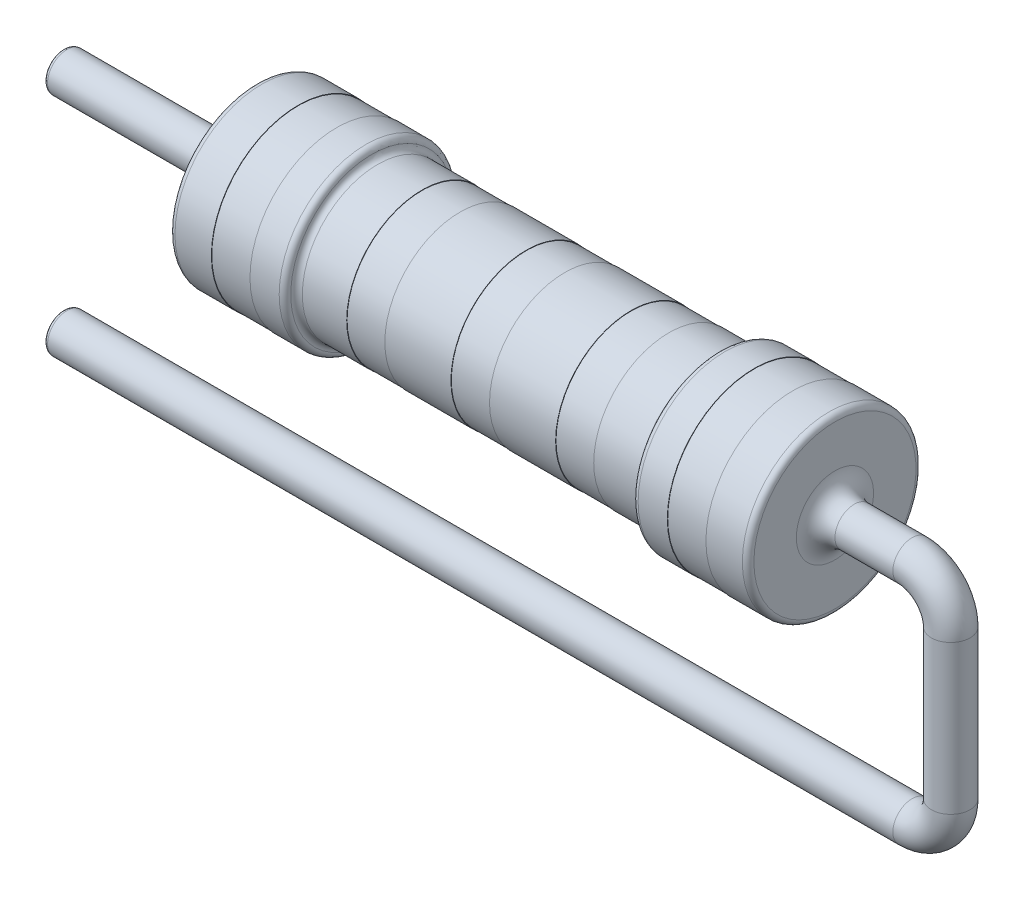
ISO-10303-21;
HEADER;
FILE_DESCRIPTION(('STEP AP214'),'2;1');
FILE_NAME('part.step','',(''),(''),'','','');
FILE_SCHEMA(('AUTOMOTIVE_DESIGN { 1 0 10303 214 1 1 1 1 }'));
ENDSEC;
DATA;
#1=APPLICATION_CONTEXT('core data for automotive mechanical design processes');
#2=APPLICATION_PROTOCOL_DEFINITION('international standard','automotive_design',2000,#1);
#3=PRODUCT_CONTEXT('',#1,'mechanical');
#4=PRODUCT('Part','Part','',(#3));
#5=PRODUCT_RELATED_PRODUCT_CATEGORY('part','',(#4));
#6=PRODUCT_DEFINITION_FORMATION('','',#4);
#7=PRODUCT_DEFINITION_CONTEXT('part definition',#1,'design');
#8=PRODUCT_DEFINITION('design','',#6,#7);
#9=PRODUCT_DEFINITION_SHAPE('','',#8);
#10=(LENGTH_UNIT() NAMED_UNIT(*) SI_UNIT(.MILLI.,.METRE.));
#11=(NAMED_UNIT(*) PLANE_ANGLE_UNIT() SI_UNIT($,.RADIAN.));
#12=(NAMED_UNIT(*) SI_UNIT($,.STERADIAN.) SOLID_ANGLE_UNIT());
#13=UNCERTAINTY_MEASURE_WITH_UNIT(LENGTH_MEASURE(1.E-05),#10,'distance_accuracy_value','');
#14=(GEOMETRIC_REPRESENTATION_CONTEXT(3) GLOBAL_UNCERTAINTY_ASSIGNED_CONTEXT((#13)) GLOBAL_UNIT_ASSIGNED_CONTEXT((#10,
#11,#12)) REPRESENTATION_CONTEXT('',''));
#15=CARTESIAN_POINT('',(0.,0.,0.));
#16=DIRECTION('',(0.,0.,1.));
#17=DIRECTION('',(1.,0.,0.));
#18=AXIS2_PLACEMENT_3D('',#15,#16,#17);
#19=CARTESIAN_POINT('',(7.5,-1.89738903908675,0.));
#20=DIRECTION('',(-1.,0.,0.));
#21=DIRECTION('',(0.,0.,1.));
#22=AXIS2_PLACEMENT_3D('',#19,#20,#21);
#23=PLANE('',#22);
#24=CARTESIAN_POINT('',(7.5,-1.89738903908675,0.));
#25=DIRECTION('',(-1.,0.,0.));
#26=DIRECTION('',(0.,0.,1.));
#27=AXIS2_PLACEMENT_3D('',#24,#25,#26);
#28=CIRCLE('',#27,1.);
#29=CARTESIAN_POINT('',(7.5,-1.89738903908675,1.));
#30=VERTEX_POINT('',#29);
#31=EDGE_CURVE('E51',#30,#30,#28,.T.);
#32=ORIENTED_EDGE('',*,*,#31,.T.);
#33=EDGE_LOOP('',(#32));
#34=FACE_BOUND('',#33,.T.);
#35=CARTESIAN_POINT('',(7.5,-1.89738903908675,0.));
#36=DIRECTION('',(-1.,0.,0.));
#37=DIRECTION('',(0.,0.,1.));
#38=AXIS2_PLACEMENT_3D('',#35,#36,#37);
#39=CIRCLE('',#38,2.1);
#40=CARTESIAN_POINT('',(7.5,-1.89738903908675,2.1));
#41=VERTEX_POINT('',#40);
#42=EDGE_CURVE('E87',#41,#41,#39,.F.);
#43=ORIENTED_EDGE('',*,*,#42,.T.);
#44=EDGE_LOOP('',(#43));
#45=FACE_BOUND('',#44,.T.);
#46=ADVANCED_FACE('F36',(#34,#45),#23,.F.);
#47=CARTESIAN_POINT('',(-7.5,-1.89738903908675,0.));
#48=DIRECTION('',(-1.,0.,0.));
#49=DIRECTION('',(0.,0.,1.));
#50=AXIS2_PLACEMENT_3D('',#47,#48,#49);
#51=CYLINDRICAL_SURFACE('',#50,2.25);
#52=CARTESIAN_POINT('',(-7.35,-1.89738903908675,0.));
#53=DIRECTION('',(-1.,0.,0.));
#54=DIRECTION('',(0.,0.,1.));
#55=AXIS2_PLACEMENT_3D('',#52,#53,#54);
#56=CIRCLE('',#55,2.25);
#57=CARTESIAN_POINT('',(-7.35,-1.89738903908675,2.25));
#58=VERTEX_POINT('',#57);
#59=EDGE_CURVE('E95',#58,#58,#56,.F.);
#60=ORIENTED_EDGE('',*,*,#59,.T.);
#61=EDGE_LOOP('',(#60));
#62=FACE_BOUND('',#61,.T.);
#63=CARTESIAN_POINT('',(-6.40684922175231,-1.89738903908675,0.));
#64=DIRECTION('',(-1.,0.,0.));
#65=DIRECTION('',(0.,0.,1.));
#66=AXIS2_PLACEMENT_3D('',#63,#64,#65);
#67=CIRCLE('',#66,2.25);
#68=CARTESIAN_POINT('',(-6.40684922175231,-1.89738903908675,2.25));
#69=VERTEX_POINT('',#68);
#70=EDGE_CURVE('E119',#69,#69,#67,.T.);
#71=ORIENTED_EDGE('',*,*,#70,.T.);
#72=EDGE_LOOP('',(#71));
#73=FACE_BOUND('',#72,.T.);
#74=ADVANCED_FACE('F231',(#62,#73),#51,.T.);
#75=CARTESIAN_POINT('',(-6.40684922175231,-4.14738903908675,0.));
#76=DIRECTION('',(1.,0.,0.));
#77=DIRECTION('',(0.,0.,-1.));
#78=AXIS2_PLACEMENT_3D('',#75,#76,#77);
#79=PLANE('',#78);
#80=CARTESIAN_POINT('',(-6.40684922175231,-1.89738903908675,0.));
#81=DIRECTION('',(-1.,0.,0.));
#82=DIRECTION('',(0.,0.,1.));
#83=AXIS2_PLACEMENT_3D('',#80,#81,#82);
#84=CIRCLE('',#83,2.24);
#85=CARTESIAN_POINT('',(-6.40684922175231,-1.89738903908675,2.24));
#86=VERTEX_POINT('',#85);
#87=EDGE_CURVE('E123',#86,#86,#84,.T.);
#88=ORIENTED_EDGE('',*,*,#87,.T.);
#89=EDGE_LOOP('',(#88));
#90=FACE_BOUND('',#89,.T.);
#91=ORIENTED_EDGE('',*,*,#70,.F.);
#92=EDGE_LOOP('',(#91));
#93=FACE_BOUND('',#92,.T.);
#94=ADVANCED_FACE('F237',(#90,#93),#79,.T.);
#95=CARTESIAN_POINT('',(-7.5,-1.89738903908675,0.));
#96=DIRECTION('',(-1.,0.,0.));
#97=DIRECTION('',(0.,0.,1.));
#98=AXIS2_PLACEMENT_3D('',#95,#96,#97);
#99=CYLINDRICAL_SURFACE('',#98,2.24);
#100=CARTESIAN_POINT('',(-5.40684922175231,-1.89738903908675,0.));
#101=DIRECTION('',(-1.,0.,0.));
#102=DIRECTION('',(0.,0.,1.));
#103=AXIS2_PLACEMENT_3D('',#100,#101,#102);
#104=CIRCLE('',#103,2.24);
#105=CARTESIAN_POINT('',(-5.40684922175231,-1.89738903908675,2.24));
#106=VERTEX_POINT('',#105);
#107=EDGE_CURVE('E127',#106,#106,#104,.T.);
#108=ORIENTED_EDGE('',*,*,#107,.T.);
#109=EDGE_LOOP('',(#108));
#110=FACE_BOUND('',#109,.T.);
#111=ORIENTED_EDGE('',*,*,#87,.F.);
#112=EDGE_LOOP('',(#111));
#113=FACE_BOUND('',#112,.T.);
#114=ADVANCED_FACE('F324',(#110,#113),#99,.T.);
#115=CARTESIAN_POINT('',(-5.40684922175231,-4.13738903908675,0.));
#116=DIRECTION('',(-1.,0.,0.));
#117=DIRECTION('',(0.,0.,1.));
#118=AXIS2_PLACEMENT_3D('',#115,#116,#117);
#119=PLANE('',#118);
#120=CARTESIAN_POINT('',(-5.40684922175231,-1.89738903908675,0.));
#121=DIRECTION('',(-1.,0.,0.));
#122=DIRECTION('',(0.,0.,1.));
#123=AXIS2_PLACEMENT_3D('',#120,#121,#122);
#124=CIRCLE('',#123,2.24999999999999);
#125=CARTESIAN_POINT('',(-5.40684922175231,-1.89738903908675,2.24999999999999));
#126=VERTEX_POINT('',#125);
#127=EDGE_CURVE('E130',#126,#126,#124,.T.);
#128=ORIENTED_EDGE('',*,*,#127,.T.);
#129=EDGE_LOOP('',(#128));
#130=FACE_BOUND('',#129,.T.);
#131=ORIENTED_EDGE('',*,*,#107,.F.);
#132=EDGE_LOOP('',(#131));
#133=FACE_BOUND('',#132,.T.);
#134=ADVANCED_FACE('F320',(#130,#133),#119,.T.);
#135=CARTESIAN_POINT('',(-7.5,-1.89738903908675,0.));
#136=DIRECTION('',(-1.,0.,0.));
#137=DIRECTION('',(0.,0.,1.));
#138=AXIS2_PLACEMENT_3D('',#135,#136,#137);
#139=CYLINDRICAL_SURFACE('',#138,2.24999999999999);
#140=CARTESIAN_POINT('',(-4.65,-1.89738903908675,0.));
#141=DIRECTION('',(1.,0.,0.));
#142=DIRECTION('',(0.,0.,-1.));
#143=AXIS2_PLACEMENT_3D('',#140,#141,#142);
#144=CIRCLE('',#143,2.24999999999999);
#145=CARTESIAN_POINT('',(-4.65,-1.89738903908675,-2.24999999999999));
#146=VERTEX_POINT('',#145);
#147=EDGE_CURVE('E107',#146,#146,#144,.F.);
#148=ORIENTED_EDGE('',*,*,#147,.T.);
#149=EDGE_LOOP('',(#148));
#150=FACE_BOUND('',#149,.T.);
#151=ORIENTED_EDGE('',*,*,#127,.F.);
#152=EDGE_LOOP('',(#151));
#153=FACE_BOUND('',#152,.T.);
#154=ADVANCED_FACE('F316',(#150,#153),#139,.T.);
#155=CARTESIAN_POINT('',(-7.5,-1.89738903908675,0.));
#156=DIRECTION('',(-1.,0.,0.));
#157=DIRECTION('',(0.,0.,1.));
#158=AXIS2_PLACEMENT_3D('',#155,#156,#157);
#159=CYLINDRICAL_SURFACE('',#158,1.95);
#160=CARTESIAN_POINT('',(-4.35,-1.89738903908675,0.));
#161=DIRECTION('',(1.,0.,0.));
#162=DIRECTION('',(0.,0.,-1.));
#163=AXIS2_PLACEMENT_3D('',#160,#161,#162);
#164=CIRCLE('',#163,1.95);
#165=CARTESIAN_POINT('',(-4.35,-1.89738903908675,-1.95));
#166=VERTEX_POINT('',#165);
#167=EDGE_CURVE('E79',#166,#166,#164,.T.);
#168=ORIENTED_EDGE('',*,*,#167,.T.);
#169=EDGE_LOOP('',(#168));
#170=FACE_BOUND('',#169,.T.);
#171=CARTESIAN_POINT('',(-3.2,-1.89738903908675,0.));
#172=DIRECTION('',(-1.,0.,0.));
#173=DIRECTION('',(0.,0.,1.));
#174=AXIS2_PLACEMENT_3D('',#171,#172,#173);
#175=CIRCLE('',#174,1.95);
#176=CARTESIAN_POINT('',(-3.2,-1.89738903908675,1.95));
#177=VERTEX_POINT('',#176);
#178=EDGE_CURVE('E134',#177,#177,#175,.T.);
#179=ORIENTED_EDGE('',*,*,#178,.T.);
#180=EDGE_LOOP('',(#179));
#181=FACE_BOUND('',#180,.T.);
#182=ADVANCED_FACE('F312',(#170,#181),#159,.T.);
#183=CARTESIAN_POINT('',(-3.2,-3.84738903908675,0.));
#184=DIRECTION('',(1.,0.,0.));
#185=DIRECTION('',(0.,0.,-1.));
#186=AXIS2_PLACEMENT_3D('',#183,#184,#185);
#187=PLANE('',#186);
#188=CARTESIAN_POINT('',(-3.2,-1.89738903908675,0.));
#189=DIRECTION('',(-1.,0.,0.));
#190=DIRECTION('',(0.,0.,1.));
#191=AXIS2_PLACEMENT_3D('',#188,#189,#190);
#192=CIRCLE('',#191,1.94);
#193=CARTESIAN_POINT('',(-3.2,-1.89738903908675,1.94));
#194=VERTEX_POINT('',#193);
#195=EDGE_CURVE('E137',#194,#194,#192,.T.);
#196=ORIENTED_EDGE('',*,*,#195,.T.);
#197=EDGE_LOOP('',(#196));
#198=FACE_BOUND('',#197,.T.);
#199=ORIENTED_EDGE('',*,*,#178,.F.);
#200=EDGE_LOOP('',(#199));
#201=FACE_BOUND('',#200,.T.);
#202=ADVANCED_FACE('F308',(#198,#201),#187,.T.);
#203=CARTESIAN_POINT('',(-7.5,-1.89738903908675,0.));
#204=DIRECTION('',(-1.,0.,0.));
#205=DIRECTION('',(0.,0.,1.));
#206=AXIS2_PLACEMENT_3D('',#203,#204,#205);
#207=CYLINDRICAL_SURFACE('',#206,1.94);
#208=CARTESIAN_POINT('',(-2.21268048519063,-1.89738903908675,0.));
#209=DIRECTION('',(-1.,0.,0.));
#210=DIRECTION('',(0.,0.,1.));
#211=AXIS2_PLACEMENT_3D('',#208,#209,#210);
#212=CIRCLE('',#211,1.94);
#213=CARTESIAN_POINT('',(-2.21268048519063,-1.89738903908675,1.94));
#214=VERTEX_POINT('',#213);
#215=EDGE_CURVE('E141',#214,#214,#212,.T.);
#216=ORIENTED_EDGE('',*,*,#215,.T.);
#217=EDGE_LOOP('',(#216));
#218=FACE_BOUND('',#217,.T.);
#219=ORIENTED_EDGE('',*,*,#195,.F.);
#220=EDGE_LOOP('',(#219));
#221=FACE_BOUND('',#220,.T.);
#222=ADVANCED_FACE('F304',(#218,#221),#207,.T.);
#223=CARTESIAN_POINT('',(-2.21268048519063,-3.83738903908675,0.));
#224=DIRECTION('',(-1.,0.,0.));
#225=DIRECTION('',(0.,0.,1.));
#226=AXIS2_PLACEMENT_3D('',#223,#224,#225);
#227=PLANE('',#226);
#228=CARTESIAN_POINT('',(-2.21268048519063,-1.89738903908675,0.));
#229=DIRECTION('',(-1.,0.,0.));
#230=DIRECTION('',(0.,0.,1.));
#231=AXIS2_PLACEMENT_3D('',#228,#229,#230);
#232=CIRCLE('',#231,1.95);
#233=CARTESIAN_POINT('',(-2.21268048519063,-1.89738903908675,1.95));
#234=VERTEX_POINT('',#233);
#235=EDGE_CURVE('E145',#234,#234,#232,.T.);
#236=ORIENTED_EDGE('',*,*,#235,.T.);
#237=EDGE_LOOP('',(#236));
#238=FACE_BOUND('',#237,.T.);
#239=ORIENTED_EDGE('',*,*,#215,.F.);
#240=EDGE_LOOP('',(#239));
#241=FACE_BOUND('',#240,.T.);
#242=ADVANCED_FACE('F300',(#238,#241),#227,.T.);
#243=CARTESIAN_POINT('',(-7.5,-1.89738903908675,0.));
#244=DIRECTION('',(-1.,0.,0.));
#245=DIRECTION('',(0.,0.,1.));
#246=AXIS2_PLACEMENT_3D('',#243,#244,#245);
#247=CYLINDRICAL_SURFACE('',#246,1.95);
#248=CARTESIAN_POINT('',(-0.5,-1.89738903908675,0.));
#249=DIRECTION('',(-1.,0.,0.));
#250=DIRECTION('',(0.,0.,1.));
#251=AXIS2_PLACEMENT_3D('',#248,#249,#250);
#252=CIRCLE('',#251,1.95);
#253=CARTESIAN_POINT('',(-0.5,-1.89738903908675,1.95));
#254=VERTEX_POINT('',#253);
#255=EDGE_CURVE('E149',#254,#254,#252,.T.);
#256=ORIENTED_EDGE('',*,*,#255,.T.);
#257=EDGE_LOOP('',(#256));
#258=FACE_BOUND('',#257,.T.);
#259=ORIENTED_EDGE('',*,*,#235,.F.);
#260=EDGE_LOOP('',(#259));
#261=FACE_BOUND('',#260,.T.);
#262=ADVANCED_FACE('F296',(#258,#261),#247,.T.);
#263=CARTESIAN_POINT('',(-0.5,-3.84738903908675,0.));
#264=DIRECTION('',(1.,0.,0.));
#265=DIRECTION('',(0.,0.,-1.));
#266=AXIS2_PLACEMENT_3D('',#263,#264,#265);
#267=PLANE('',#266);
#268=CARTESIAN_POINT('',(-0.5,-1.89738903908675,0.));
#269=DIRECTION('',(-1.,0.,0.));
#270=DIRECTION('',(0.,0.,1.));
#271=AXIS2_PLACEMENT_3D('',#268,#269,#270);
#272=CIRCLE('',#271,1.94);
#273=CARTESIAN_POINT('',(-0.5,-1.89738903908675,1.94));
#274=VERTEX_POINT('',#273);
#275=EDGE_CURVE('E153',#274,#274,#272,.T.);
#276=ORIENTED_EDGE('',*,*,#275,.T.);
#277=EDGE_LOOP('',(#276));
#278=FACE_BOUND('',#277,.T.);
#279=ORIENTED_EDGE('',*,*,#255,.F.);
#280=EDGE_LOOP('',(#279));
#281=FACE_BOUND('',#280,.T.);
#282=ADVANCED_FACE('F292',(#278,#281),#267,.T.);
#283=CARTESIAN_POINT('',(-7.5,-1.89738903908675,0.));
#284=DIRECTION('',(-1.,0.,0.));
#285=DIRECTION('',(0.,0.,1.));
#286=AXIS2_PLACEMENT_3D('',#283,#284,#285);
#287=CYLINDRICAL_SURFACE('',#286,1.94);
#288=ORIENTED_EDGE('',*,*,#275,.F.);
#289=EDGE_LOOP('',(#288));
#290=FACE_BOUND('',#289,.T.);
#291=CARTESIAN_POINT('',(0.5,-1.89738903908675,0.));
#292=DIRECTION('',(-1.,0.,0.));
#293=DIRECTION('',(0.,0.,1.));
#294=AXIS2_PLACEMENT_3D('',#291,#292,#293);
#295=CIRCLE('',#294,1.94);
#296=CARTESIAN_POINT('',(0.5,-1.89738903908675,1.94));
#297=VERTEX_POINT('',#296);
#298=EDGE_CURVE('E157',#297,#297,#295,.T.);
#299=ORIENTED_EDGE('',*,*,#298,.T.);
#300=EDGE_LOOP('',(#299));
#301=FACE_BOUND('',#300,.T.);
#302=ADVANCED_FACE('F288',(#290,#301),#287,.T.);
#303=CARTESIAN_POINT('',(0.5,-3.84738903908675,0.));
#304=DIRECTION('',(1.,0.,0.));
#305=DIRECTION('',(0.,0.,-1.));
#306=AXIS2_PLACEMENT_3D('',#303,#304,#305);
#307=PLANE('',#306);
#308=ORIENTED_EDGE('',*,*,#298,.F.);
#309=EDGE_LOOP('',(#308));
#310=FACE_BOUND('',#309,.T.);
#311=CARTESIAN_POINT('',(0.5,-1.89738903908675,0.));
#312=DIRECTION('',(-1.,0.,0.));
#313=DIRECTION('',(0.,0.,1.));
#314=AXIS2_PLACEMENT_3D('',#311,#312,#313);
#315=CIRCLE('',#314,1.95);
#316=CARTESIAN_POINT('',(0.5,-1.89738903908675,1.95));
#317=VERTEX_POINT('',#316);
#318=EDGE_CURVE('E160',#317,#317,#315,.T.);
#319=ORIENTED_EDGE('',*,*,#318,.T.);
#320=EDGE_LOOP('',(#319));
#321=FACE_BOUND('',#320,.T.);
#322=ADVANCED_FACE('F284',(#310,#321),#307,.F.);
#323=CARTESIAN_POINT('',(-7.5,-1.89738903908675,0.));
#324=DIRECTION('',(-1.,0.,0.));
#325=DIRECTION('',(0.,0.,1.));
#326=AXIS2_PLACEMENT_3D('',#323,#324,#325);
#327=CYLINDRICAL_SURFACE('',#326,1.95);
#328=ORIENTED_EDGE('',*,*,#318,.F.);
#329=EDGE_LOOP('',(#328));
#330=FACE_BOUND('',#329,.T.);
#331=CARTESIAN_POINT('',(2.21268048519063,-1.89738903908675,0.));
#332=DIRECTION('',(-1.,0.,0.));
#333=DIRECTION('',(0.,0.,1.));
#334=AXIS2_PLACEMENT_3D('',#331,#332,#333);
#335=CIRCLE('',#334,1.95);
#336=CARTESIAN_POINT('',(2.21268048519063,-1.89738903908675,1.95));
#337=VERTEX_POINT('',#336);
#338=EDGE_CURVE('E164',#337,#337,#335,.T.);
#339=ORIENTED_EDGE('',*,*,#338,.T.);
#340=EDGE_LOOP('',(#339));
#341=FACE_BOUND('',#340,.T.);
#342=ADVANCED_FACE('F280',(#330,#341),#327,.T.);
#343=CARTESIAN_POINT('',(2.21268048519063,-3.83738903908675,0.));
#344=DIRECTION('',(-1.,0.,0.));
#345=DIRECTION('',(0.,0.,1.));
#346=AXIS2_PLACEMENT_3D('',#343,#344,#345);
#347=PLANE('',#346);
#348=ORIENTED_EDGE('',*,*,#338,.F.);
#349=EDGE_LOOP('',(#348));
#350=FACE_BOUND('',#349,.T.);
#351=CARTESIAN_POINT('',(2.21268048519063,-1.89738903908675,0.));
#352=DIRECTION('',(-1.,0.,0.));
#353=DIRECTION('',(0.,0.,1.));
#354=AXIS2_PLACEMENT_3D('',#351,#352,#353);
#355=CIRCLE('',#354,1.94);
#356=CARTESIAN_POINT('',(2.21268048519063,-1.89738903908675,1.94));
#357=VERTEX_POINT('',#356);
#358=EDGE_CURVE('E168',#357,#357,#355,.T.);
#359=ORIENTED_EDGE('',*,*,#358,.T.);
#360=EDGE_LOOP('',(#359));
#361=FACE_BOUND('',#360,.T.);
#362=ADVANCED_FACE('F276',(#350,#361),#347,.F.);
#363=CARTESIAN_POINT('',(-7.5,-1.89738903908675,0.));
#364=DIRECTION('',(-1.,0.,0.));
#365=DIRECTION('',(0.,0.,1.));
#366=AXIS2_PLACEMENT_3D('',#363,#364,#365);
#367=CYLINDRICAL_SURFACE('',#366,1.94);
#368=ORIENTED_EDGE('',*,*,#358,.F.);
#369=EDGE_LOOP('',(#368));
#370=FACE_BOUND('',#369,.T.);
#371=CARTESIAN_POINT('',(3.2,-1.89738903908675,0.));
#372=DIRECTION('',(-1.,0.,0.));
#373=DIRECTION('',(0.,0.,1.));
#374=AXIS2_PLACEMENT_3D('',#371,#372,#373);
#375=CIRCLE('',#374,1.94);
#376=CARTESIAN_POINT('',(3.2,-1.89738903908675,1.94));
#377=VERTEX_POINT('',#376);
#378=EDGE_CURVE('E172',#377,#377,#375,.T.);
#379=ORIENTED_EDGE('',*,*,#378,.T.);
#380=EDGE_LOOP('',(#379));
#381=FACE_BOUND('',#380,.T.);
#382=ADVANCED_FACE('F272',(#370,#381),#367,.T.);
#383=CARTESIAN_POINT('',(3.2,-3.84738903908675,0.));
#384=DIRECTION('',(1.,0.,0.));
#385=DIRECTION('',(0.,0.,-1.));
#386=AXIS2_PLACEMENT_3D('',#383,#384,#385);
#387=PLANE('',#386);
#388=ORIENTED_EDGE('',*,*,#378,.F.);
#389=EDGE_LOOP('',(#388));
#390=FACE_BOUND('',#389,.T.);
#391=CARTESIAN_POINT('',(3.2,-1.89738903908675,0.));
#392=DIRECTION('',(-1.,0.,0.));
#393=DIRECTION('',(0.,0.,1.));
#394=AXIS2_PLACEMENT_3D('',#391,#392,#393);
#395=CIRCLE('',#394,1.95);
#396=CARTESIAN_POINT('',(3.2,-1.89738903908675,1.95));
#397=VERTEX_POINT('',#396);
#398=EDGE_CURVE('E176',#397,#397,#395,.T.);
#399=ORIENTED_EDGE('',*,*,#398,.T.);
#400=EDGE_LOOP('',(#399));
#401=FACE_BOUND('',#400,.T.);
#402=ADVANCED_FACE('F268',(#390,#401),#387,.F.);
#403=CARTESIAN_POINT('',(-7.5,-1.89738903908675,0.));
#404=DIRECTION('',(-1.,0.,0.));
#405=DIRECTION('',(0.,0.,1.));
#406=AXIS2_PLACEMENT_3D('',#403,#404,#405);
#407=CYLINDRICAL_SURFACE('',#406,1.95);
#408=CARTESIAN_POINT('',(4.35,-1.89738903908675,0.));
#409=DIRECTION('',(1.,0.,0.));
#410=DIRECTION('',(0.,0.,-1.));
#411=AXIS2_PLACEMENT_3D('',#408,#409,#410);
#412=CIRCLE('',#411,1.95);
#413=CARTESIAN_POINT('',(4.35,-1.89738903908675,-1.95));
#414=VERTEX_POINT('',#413);
#415=EDGE_CURVE('E83',#414,#414,#412,.F.);
#416=ORIENTED_EDGE('',*,*,#415,.T.);
#417=EDGE_LOOP('',(#416));
#418=FACE_BOUND('',#417,.T.);
#419=ORIENTED_EDGE('',*,*,#398,.F.);
#420=EDGE_LOOP('',(#419));
#421=FACE_BOUND('',#420,.T.);
#422=ADVANCED_FACE('F264',(#418,#421),#407,.T.);
#423=CARTESIAN_POINT('',(-7.5,-1.89738903908675,0.));
#424=DIRECTION('',(-1.,0.,0.));
#425=DIRECTION('',(0.,0.,1.));
#426=AXIS2_PLACEMENT_3D('',#423,#424,#425);
#427=CYLINDRICAL_SURFACE('',#426,2.25);
#428=CARTESIAN_POINT('',(4.65,-1.89738903908675,0.));
#429=DIRECTION('',(1.,0.,0.));
#430=DIRECTION('',(0.,0.,-1.));
#431=AXIS2_PLACEMENT_3D('',#428,#429,#430);
#432=CIRCLE('',#431,2.25);
#433=CARTESIAN_POINT('',(4.65,-1.89738903908675,-2.25));
#434=VERTEX_POINT('',#433);
#435=EDGE_CURVE('E111',#434,#434,#432,.T.);
#436=ORIENTED_EDGE('',*,*,#435,.T.);
#437=EDGE_LOOP('',(#436));
#438=FACE_BOUND('',#437,.T.);
#439=CARTESIAN_POINT('',(5.40684922175231,-1.89738903908675,0.));
#440=DIRECTION('',(-1.,0.,0.));
#441=DIRECTION('',(0.,0.,1.));
#442=AXIS2_PLACEMENT_3D('',#439,#440,#441);
#443=CIRCLE('',#442,2.25);
#444=CARTESIAN_POINT('',(5.40684922175231,-1.89738903908675,2.25));
#445=VERTEX_POINT('',#444);
#446=EDGE_CURVE('E180',#445,#445,#443,.T.);
#447=ORIENTED_EDGE('',*,*,#446,.T.);
#448=EDGE_LOOP('',(#447));
#449=FACE_BOUND('',#448,.T.);
#450=ADVANCED_FACE('F260',(#438,#449),#427,.T.);
#451=CARTESIAN_POINT('',(5.40684922175231,-4.13738903908675,0.));
#452=DIRECTION('',(-1.,0.,0.));
#453=DIRECTION('',(0.,0.,1.));
#454=AXIS2_PLACEMENT_3D('',#451,#452,#453);
#455=PLANE('',#454);
#456=ORIENTED_EDGE('',*,*,#446,.F.);
#457=EDGE_LOOP('',(#456));
#458=FACE_BOUND('',#457,.T.);
#459=CARTESIAN_POINT('',(5.40684922175231,-1.89738903908675,0.));
#460=DIRECTION('',(-1.,0.,0.));
#461=DIRECTION('',(0.,0.,1.));
#462=AXIS2_PLACEMENT_3D('',#459,#460,#461);
#463=CIRCLE('',#462,2.24);
#464=CARTESIAN_POINT('',(5.40684922175231,-1.89738903908675,2.24));
#465=VERTEX_POINT('',#464);
#466=EDGE_CURVE('E184',#465,#465,#463,.T.);
#467=ORIENTED_EDGE('',*,*,#466,.T.);
#468=EDGE_LOOP('',(#467));
#469=FACE_BOUND('',#468,.T.);
#470=ADVANCED_FACE('F256',(#458,#469),#455,.F.);
#471=CARTESIAN_POINT('',(-7.5,-1.89738903908675,0.));
#472=DIRECTION('',(-1.,0.,0.));
#473=DIRECTION('',(0.,0.,1.));
#474=AXIS2_PLACEMENT_3D('',#471,#472,#473);
#475=CYLINDRICAL_SURFACE('',#474,2.24);
#476=ORIENTED_EDGE('',*,*,#466,.F.);
#477=EDGE_LOOP('',(#476));
#478=FACE_BOUND('',#477,.T.);
#479=CARTESIAN_POINT('',(6.40684922175231,-1.89738903908675,0.));
#480=DIRECTION('',(-1.,0.,0.));
#481=DIRECTION('',(0.,0.,1.));
#482=AXIS2_PLACEMENT_3D('',#479,#480,#481);
#483=CIRCLE('',#482,2.24);
#484=CARTESIAN_POINT('',(6.40684922175231,-1.89738903908675,2.24));
#485=VERTEX_POINT('',#484);
#486=EDGE_CURVE('E188',#485,#485,#483,.T.);
#487=ORIENTED_EDGE('',*,*,#486,.T.);
#488=EDGE_LOOP('',(#487));
#489=FACE_BOUND('',#488,.T.);
#490=ADVANCED_FACE('F252',(#478,#489),#475,.T.);
#491=CARTESIAN_POINT('',(6.40684922175231,-4.14738903908675,0.));
#492=DIRECTION('',(1.,0.,0.));
#493=DIRECTION('',(0.,0.,-1.));
#494=AXIS2_PLACEMENT_3D('',#491,#492,#493);
#495=PLANE('',#494);
#496=ORIENTED_EDGE('',*,*,#486,.F.);
#497=EDGE_LOOP('',(#496));
#498=FACE_BOUND('',#497,.T.);
#499=CARTESIAN_POINT('',(6.40684922175231,-1.89738903908675,0.));
#500=DIRECTION('',(-1.,0.,0.));
#501=DIRECTION('',(0.,0.,1.));
#502=AXIS2_PLACEMENT_3D('',#499,#500,#501);
#503=CIRCLE('',#502,2.25);
#504=CARTESIAN_POINT('',(6.40684922175231,-1.89738903908675,2.25));
#505=VERTEX_POINT('',#504);
#506=EDGE_CURVE('E192',#505,#505,#503,.T.);
#507=ORIENTED_EDGE('',*,*,#506,.T.);
#508=EDGE_LOOP('',(#507));
#509=FACE_BOUND('',#508,.T.);
#510=ADVANCED_FACE('F248',(#498,#509),#495,.F.);
#511=CARTESIAN_POINT('',(-7.5,-1.89738903908675,0.));
#512=DIRECTION('',(-1.,0.,0.));
#513=DIRECTION('',(0.,0.,1.));
#514=AXIS2_PLACEMENT_3D('',#511,#512,#513);
#515=CYLINDRICAL_SURFACE('',#514,2.25);
#516=CARTESIAN_POINT('',(7.35,-1.89738903908675,0.));
#517=DIRECTION('',(-1.,0.,0.));
#518=DIRECTION('',(0.,0.,1.));
#519=AXIS2_PLACEMENT_3D('',#516,#517,#518);
#520=CIRCLE('',#519,2.25);
#521=CARTESIAN_POINT('',(7.35,-1.89738903908675,2.25));
#522=VERTEX_POINT('',#521);
#523=EDGE_CURVE('E91',#522,#522,#520,.T.);
#524=ORIENTED_EDGE('',*,*,#523,.T.);
#525=EDGE_LOOP('',(#524));
#526=FACE_BOUND('',#525,.T.);
#527=ORIENTED_EDGE('',*,*,#506,.F.);
#528=EDGE_LOOP('',(#527));
#529=FACE_BOUND('',#528,.T.);
#530=ADVANCED_FACE('F245',(#526,#529),#515,.T.);
#531=CARTESIAN_POINT('',(-7.5,-1.89738903908675,0.));
#532=DIRECTION('',(-1.,0.,0.));
#533=DIRECTION('',(0.,0.,1.));
#534=AXIS2_PLACEMENT_3D('',#531,#532,#533);
#535=PLANE('',#534);
#536=CARTESIAN_POINT('',(-7.5,-1.89738903908675,0.));
#537=DIRECTION('',(-1.,0.,0.));
#538=DIRECTION('',(0.,0.,1.));
#539=AXIS2_PLACEMENT_3D('',#536,#537,#538);
#540=CIRCLE('',#539,1.);
#541=CARTESIAN_POINT('',(-7.5,-1.89738903908675,1.));
#542=VERTEX_POINT('',#541);
#543=EDGE_CURVE('E10',#542,#542,#540,.F.);
#544=ORIENTED_EDGE('',*,*,#543,.T.);
#545=EDGE_LOOP('',(#544));
#546=FACE_BOUND('',#545,.T.);
#547=CARTESIAN_POINT('',(-7.5,-1.89738903908675,0.));
#548=DIRECTION('',(-1.,0.,0.));
#549=DIRECTION('',(0.,0.,1.));
#550=AXIS2_PLACEMENT_3D('',#547,#548,#549);
#551=CIRCLE('',#550,2.1);
#552=CARTESIAN_POINT('',(-7.5,-1.89738903908675,2.1));
#553=VERTEX_POINT('',#552);
#554=EDGE_CURVE('E99',#553,#553,#551,.T.);
#555=ORIENTED_EDGE('',*,*,#554,.T.);
#556=EDGE_LOOP('',(#555));
#557=FACE_BOUND('',#556,.T.);
#558=ADVANCED_FACE('F243',(#546,#557),#535,.T.);
#559=CARTESIAN_POINT('',(4.65,-1.89738903908675,0.));
#560=DIRECTION('',(1.,0.,0.));
#561=DIRECTION('',(0.,0.,-1.));
#562=AXIS2_PLACEMENT_3D('',#559,#560,#561);
#563=TOROIDAL_SURFACE('',#562,2.1,0.15);
#564=ORIENTED_EDGE('',*,*,#435,.F.);
#565=EDGE_LOOP('',(#564));
#566=FACE_BOUND('',#565,.T.);
#567=CARTESIAN_POINT('',(4.5,-1.89738903908675,0.));
#568=DIRECTION('',(1.,0.,0.));
#569=DIRECTION('',(0.,0.,-1.));
#570=AXIS2_PLACEMENT_3D('',#567,#568,#569);
#571=CIRCLE('',#570,2.1);
#572=CARTESIAN_POINT('',(4.5,-1.89738903908675,-2.1));
#573=VERTEX_POINT('',#572);
#574=EDGE_CURVE('E115',#573,#573,#571,.F.);
#575=ORIENTED_EDGE('',*,*,#574,.F.);
#576=EDGE_LOOP('',(#575));
#577=FACE_BOUND('',#576,.T.);
#578=ADVANCED_FACE('F332',(#566,#577),#563,.T.);
#579=CARTESIAN_POINT('',(-4.65,-1.89738903908675,0.));
#580=DIRECTION('',(1.,0.,0.));
#581=DIRECTION('',(0.,0.,-1.));
#582=AXIS2_PLACEMENT_3D('',#579,#580,#581);
#583=TOROIDAL_SURFACE('',#582,2.09999999999999,0.15);
#584=CARTESIAN_POINT('',(-4.5,-1.89738903908675,0.));
#585=DIRECTION('',(1.,0.,0.));
#586=DIRECTION('',(0.,0.,-1.));
#587=AXIS2_PLACEMENT_3D('',#584,#585,#586);
#588=CIRCLE('',#587,2.09999999999999);
#589=CARTESIAN_POINT('',(-4.5,-1.89738903908675,-2.09999999999999));
#590=VERTEX_POINT('',#589);
#591=EDGE_CURVE('E103',#590,#590,#588,.T.);
#592=ORIENTED_EDGE('',*,*,#591,.F.);
#593=EDGE_LOOP('',(#592));
#594=FACE_BOUND('',#593,.T.);
#595=ORIENTED_EDGE('',*,*,#147,.F.);
#596=EDGE_LOOP('',(#595));
#597=FACE_BOUND('',#596,.T.);
#598=ADVANCED_FACE('F335',(#594,#597),#583,.T.);
#599=CARTESIAN_POINT('',(-7.35,-1.89738903908675,0.));
#600=DIRECTION('',(-1.,0.,0.));
#601=DIRECTION('',(0.,0.,1.));
#602=AXIS2_PLACEMENT_3D('',#599,#600,#601);
#603=TOROIDAL_SURFACE('',#602,2.1,0.15);
#604=ORIENTED_EDGE('',*,*,#59,.F.);
#605=EDGE_LOOP('',(#604));
#606=FACE_BOUND('',#605,.T.);
#607=ORIENTED_EDGE('',*,*,#554,.F.);
#608=EDGE_LOOP('',(#607));
#609=FACE_BOUND('',#608,.T.);
#610=ADVANCED_FACE('F339',(#606,#609),#603,.T.);
#611=CARTESIAN_POINT('',(7.35,-1.89738903908675,0.));
#612=DIRECTION('',(-1.,0.,0.));
#613=DIRECTION('',(0.,0.,1.));
#614=AXIS2_PLACEMENT_3D('',#611,#612,#613);
#615=TOROIDAL_SURFACE('',#614,2.1,0.15);
#616=ORIENTED_EDGE('',*,*,#42,.F.);
#617=EDGE_LOOP('',(#616));
#618=FACE_BOUND('',#617,.T.);
#619=ORIENTED_EDGE('',*,*,#523,.F.);
#620=EDGE_LOOP('',(#619));
#621=FACE_BOUND('',#620,.T.);
#622=ADVANCED_FACE('F343',(#618,#621),#615,.T.);
#623=CARTESIAN_POINT('',(4.35,-1.89738903908675,0.));
#624=DIRECTION('',(1.,0.,0.));
#625=DIRECTION('',(0.,0.,-1.));
#626=AXIS2_PLACEMENT_3D('',#623,#624,#625);
#627=TOROIDAL_SURFACE('',#626,2.1,0.15);
#628=ORIENTED_EDGE('',*,*,#574,.T.);
#629=EDGE_LOOP('',(#628));
#630=FACE_BOUND('',#629,.T.);
#631=ORIENTED_EDGE('',*,*,#415,.F.);
#632=EDGE_LOOP('',(#631));
#633=FACE_BOUND('',#632,.T.);
#634=ADVANCED_FACE('F347',(#630,#633),#627,.F.);
#635=CARTESIAN_POINT('',(-4.35,-1.89738903908675,0.));
#636=DIRECTION('',(1.,0.,0.));
#637=DIRECTION('',(0.,0.,-1.));
#638=AXIS2_PLACEMENT_3D('',#635,#636,#637);
#639=TOROIDAL_SURFACE('',#638,2.1,0.15);
#640=ORIENTED_EDGE('',*,*,#167,.F.);
#641=EDGE_LOOP('',(#640));
#642=FACE_BOUND('',#641,.T.);
#643=ORIENTED_EDGE('',*,*,#591,.T.);
#644=EDGE_LOOP('',(#643));
#645=FACE_BOUND('',#644,.T.);
#646=ADVANCED_FACE('F351',(#642,#645),#639,.F.);
#647=CARTESIAN_POINT('',(9.5,-7.75395804307084,0.));
#648=DIRECTION('',(-1.,0.,0.));
#649=DIRECTION('',(0.,0.,1.));
#650=AXIS2_PLACEMENT_3D('',#647,#648,#649);
#651=CYLINDRICAL_SURFACE('',#650,0.5);
#652=CARTESIAN_POINT('',(-12.4,-7.75395804307084,0.));
#653=DIRECTION('',(-1.,0.,0.));
#654=DIRECTION('',(0.,-1.,0.));
#655=AXIS2_PLACEMENT_3D('',#652,#653,#654);
#656=CIRCLE('',#655,0.5);
#657=CARTESIAN_POINT('',(-12.4,-8.25395804307084,0.));
#658=VERTEX_POINT('',#657);
#659=EDGE_CURVE('E71',#658,#658,#656,.F.);
#660=ORIENTED_EDGE('',*,*,#659,.T.);
#661=EDGE_LOOP('',(#660));
#662=FACE_BOUND('',#661,.T.);
#663=CARTESIAN_POINT('',(9.5,-7.75395804307084,0.));
#664=DIRECTION('',(-1.,0.,0.));
#665=DIRECTION('',(0.,0.,-1.));
#666=AXIS2_PLACEMENT_3D('',#663,#664,#665);
#667=CIRCLE('',#666,0.5);
#668=CARTESIAN_POINT('',(9.5,-8.25395804307084,0.));
#669=VERTEX_POINT('',#668);
#670=EDGE_CURVE('E196',#669,#669,#667,.T.);
#671=ORIENTED_EDGE('',*,*,#670,.T.);
#672=EDGE_LOOP('',(#671));
#673=FACE_BOUND('',#672,.T.);
#674=ADVANCED_FACE('F355',(#662,#673),#651,.T.);
#675=CARTESIAN_POINT('',(9.5,-6.75395804307084,0.));
#676=DIRECTION('',(0.,0.,-1.));
#677=DIRECTION('',(-1.,0.,0.));
#678=AXIS2_PLACEMENT_3D('',#675,#676,#677);
#679=TOROIDAL_SURFACE('',#678,1.,0.5);
#680=CARTESIAN_POINT('',(10.5,-6.75395804307084,0.));
#681=DIRECTION('',(0.,-1.,0.));
#682=DIRECTION('',(0.,0.,-1.));
#683=AXIS2_PLACEMENT_3D('',#680,#681,#682);
#684=CIRCLE('',#683,0.5);
#685=CARTESIAN_POINT('',(11.,-6.75395804307084,0.));
#686=VERTEX_POINT('',#685);
#687=EDGE_CURVE('E200',#686,#686,#684,.T.);
#688=CARTESIAN_POINT('',(9.5,-6.75395804307084,0.));
#689=DIRECTION('',(0.,0.,-1.));
#690=DIRECTION('',(-1.,0.,0.));
#691=AXIS2_PLACEMENT_3D('',#688,#689,#690);
#692=CIRCLE('',#691,1.5);
#693=EDGE_CURVE('',#686,#669,#692,.T.);
#694=ORIENTED_EDGE('',*,*,#687,.T.);
#695=ORIENTED_EDGE('',*,*,#670,.F.);
#696=ORIENTED_EDGE('',*,*,#693,.T.);
#697=ORIENTED_EDGE('',*,*,#693,.F.);
#698=EDGE_LOOP('',(#694,#696,#695,#697));
#699=FACE_BOUND('',#698,.T.);
#700=ADVANCED_FACE('F429',(#699),#679,.T.);
#701=CARTESIAN_POINT('',(10.5,-2.89738903908675,0.));
#702=DIRECTION('',(0.,-1.,0.));
#703=DIRECTION('',(0.,0.,-1.));
#704=AXIS2_PLACEMENT_3D('',#701,#702,#703);
#705=CYLINDRICAL_SURFACE('',#704,0.5);
#706=CARTESIAN_POINT('',(10.5,-2.89738903908675,0.));
#707=DIRECTION('',(0.,-1.,0.));
#708=DIRECTION('',(0.,0.,-1.));
#709=AXIS2_PLACEMENT_3D('',#706,#707,#708);
#710=CIRCLE('',#709,0.5);
#711=CARTESIAN_POINT('',(11.,-2.89738903908675,0.));
#712=VERTEX_POINT('',#711);
#713=EDGE_CURVE('E204',#712,#712,#710,.T.);
#714=ORIENTED_EDGE('',*,*,#713,.T.);
#715=EDGE_LOOP('',(#714));
#716=FACE_BOUND('',#715,.T.);
#717=ORIENTED_EDGE('',*,*,#687,.F.);
#718=EDGE_LOOP('',(#717));
#719=FACE_BOUND('',#718,.T.);
#720=ADVANCED_FACE('F228',(#716,#719),#705,.T.);
#721=CARTESIAN_POINT('',(9.5,-2.89738903908675,0.));
#722=DIRECTION('',(0.,0.,-1.));
#723=DIRECTION('',(-1.,0.,0.));
#724=AXIS2_PLACEMENT_3D('',#721,#722,#723);
#725=TOROIDAL_SURFACE('',#724,1.,0.5);
#726=CARTESIAN_POINT('',(9.5,-1.89738903908675,0.));
#727=DIRECTION('',(1.,0.,0.));
#728=DIRECTION('',(0.,0.,-1.));
#729=AXIS2_PLACEMENT_3D('',#726,#727,#728);
#730=CIRCLE('',#729,0.5);
#731=CARTESIAN_POINT('',(9.5,-1.39738903908675,0.));
#732=VERTEX_POINT('',#731);
#733=EDGE_CURVE('E208',#732,#732,#730,.T.);
#734=CARTESIAN_POINT('',(9.5,-2.89738903908675,0.));
#735=DIRECTION('',(0.,0.,-1.));
#736=DIRECTION('',(-1.,0.,0.));
#737=AXIS2_PLACEMENT_3D('',#734,#735,#736);
#738=CIRCLE('',#737,1.5);
#739=EDGE_CURVE('',#732,#712,#738,.T.);
#740=ORIENTED_EDGE('',*,*,#733,.T.);
#741=ORIENTED_EDGE('',*,*,#713,.F.);
#742=ORIENTED_EDGE('',*,*,#739,.T.);
#743=ORIENTED_EDGE('',*,*,#739,.F.);
#744=EDGE_LOOP('',(#740,#742,#741,#743));
#745=FACE_BOUND('',#744,.T.);
#746=ADVANCED_FACE('F213',(#745),#725,.T.);
#747=CARTESIAN_POINT('',(9.5,-1.89738903908675,0.));
#748=DIRECTION('',(-1.,0.,0.));
#749=DIRECTION('',(0.,0.,1.));
#750=AXIS2_PLACEMENT_3D('',#747,#748,#749);
#751=CYLINDRICAL_SURFACE('',#750,0.5);
#752=CARTESIAN_POINT('',(8.,-1.89738903908675,0.));
#753=DIRECTION('',(-1.,0.,0.));
#754=DIRECTION('',(0.,0.,1.));
#755=AXIS2_PLACEMENT_3D('',#752,#753,#754);
#756=CIRCLE('',#755,0.5);
#757=CARTESIAN_POINT('',(8.,-1.89738903908675,0.5));
#758=VERTEX_POINT('',#757);
#759=EDGE_CURVE('E57',#758,#758,#756,.F.);
#760=ORIENTED_EDGE('',*,*,#759,.T.);
#761=EDGE_LOOP('',(#760));
#762=FACE_BOUND('',#761,.T.);
#763=ORIENTED_EDGE('',*,*,#733,.F.);
#764=EDGE_LOOP('',(#763));
#765=FACE_BOUND('',#764,.T.);
#766=ADVANCED_FACE('F216',(#762,#765),#751,.T.);
#767=CARTESIAN_POINT('',(-12.5,-7.75395804307084,0.));
#768=DIRECTION('',(-1.,0.,0.));
#769=DIRECTION('',(0.,0.,-1.));
#770=AXIS2_PLACEMENT_3D('',#767,#768,#769);
#771=PLANE('',#770);
#772=CARTESIAN_POINT('',(-12.5,-7.75395804307084,0.));
#773=DIRECTION('',(-1.,0.,0.));
#774=DIRECTION('',(0.,-1.,0.));
#775=AXIS2_PLACEMENT_3D('',#772,#773,#774);
#776=CIRCLE('',#775,0.4);
#777=CARTESIAN_POINT('',(-12.5,-8.15395804307084,0.));
#778=VERTEX_POINT('',#777);
#779=EDGE_CURVE('E75',#778,#778,#776,.T.);
#780=ORIENTED_EDGE('',*,*,#779,.T.);
#781=EDGE_LOOP('',(#780));
#782=FACE_BOUND('',#781,.T.);
#783=ADVANCED_FACE('F218',(#782),#771,.T.);
#784=CARTESIAN_POINT('',(-12.5,-1.89738903908675,0.));
#785=DIRECTION('',(1.,0.,0.));
#786=DIRECTION('',(0.,0.,-1.));
#787=AXIS2_PLACEMENT_3D('',#784,#785,#786);
#788=CYLINDRICAL_SURFACE('',#787,0.5);
#789=CARTESIAN_POINT('',(-8.,-1.89738903908675,0.));
#790=DIRECTION('',(-1.,0.,0.));
#791=DIRECTION('',(0.,0.,1.));
#792=AXIS2_PLACEMENT_3D('',#789,#790,#791);
#793=CIRCLE('',#792,0.5);
#794=CARTESIAN_POINT('',(-8.,-1.89738903908675,0.5));
#795=VERTEX_POINT('',#794);
#796=EDGE_CURVE('E44',#795,#795,#793,.T.);
#797=ORIENTED_EDGE('',*,*,#796,.T.);
#798=EDGE_LOOP('',(#797));
#799=FACE_BOUND('',#798,.T.);
#800=CARTESIAN_POINT('',(-12.4,-1.89738903908675,0.));
#801=DIRECTION('',(-1.,0.,0.));
#802=DIRECTION('',(0.,0.,1.));
#803=AXIS2_PLACEMENT_3D('',#800,#801,#802);
#804=CIRCLE('',#803,0.5);
#805=CARTESIAN_POINT('',(-12.4,-1.89738903908675,0.5));
#806=VERTEX_POINT('',#805);
#807=EDGE_CURVE('E63',#806,#806,#804,.F.);
#808=ORIENTED_EDGE('',*,*,#807,.T.);
#809=EDGE_LOOP('',(#808));
#810=FACE_BOUND('',#809,.T.);
#811=ADVANCED_FACE('F225',(#799,#810),#788,.T.);
#812=CARTESIAN_POINT('',(-12.5,-1.89738903908675,0.));
#813=DIRECTION('',(-1.,0.,0.));
#814=DIRECTION('',(0.,0.,1.));
#815=AXIS2_PLACEMENT_3D('',#812,#813,#814);
#816=PLANE('',#815);
#817=CARTESIAN_POINT('',(-12.5,-1.89738903908675,0.));
#818=DIRECTION('',(-1.,0.,0.));
#819=DIRECTION('',(0.,0.,1.));
#820=AXIS2_PLACEMENT_3D('',#817,#818,#819);
#821=CIRCLE('',#820,0.4);
#822=CARTESIAN_POINT('',(-12.5,-1.89738903908675,0.4));
#823=VERTEX_POINT('',#822);
#824=EDGE_CURVE('E67',#823,#823,#821,.T.);
#825=ORIENTED_EDGE('',*,*,#824,.T.);
#826=EDGE_LOOP('',(#825));
#827=FACE_BOUND('',#826,.T.);
#828=ADVANCED_FACE('F361',(#827),#816,.T.);
#829=CARTESIAN_POINT('',(-12.4,-7.75395804307084,0.));
#830=DIRECTION('',(-1.,0.,0.));
#831=DIRECTION('',(0.,-1.,0.));
#832=AXIS2_PLACEMENT_3D('',#829,#830,#831);
#833=TOROIDAL_SURFACE('',#832,0.4,0.1);
#834=ORIENTED_EDGE('',*,*,#659,.F.);
#835=EDGE_LOOP('',(#834));
#836=FACE_BOUND('',#835,.T.);
#837=ORIENTED_EDGE('',*,*,#779,.F.);
#838=EDGE_LOOP('',(#837));
#839=FACE_BOUND('',#838,.T.);
#840=ADVANCED_FACE('F357',(#836,#839),#833,.T.);
#841=CARTESIAN_POINT('',(-12.4,-1.89738903908675,0.));
#842=DIRECTION('',(-1.,0.,0.));
#843=DIRECTION('',(0.,0.,1.));
#844=AXIS2_PLACEMENT_3D('',#841,#842,#843);
#845=TOROIDAL_SURFACE('',#844,0.4,0.1);
#846=ORIENTED_EDGE('',*,*,#807,.F.);
#847=EDGE_LOOP('',(#846));
#848=FACE_BOUND('',#847,.T.);
#849=ORIENTED_EDGE('',*,*,#824,.F.);
#850=EDGE_LOOP('',(#849));
#851=FACE_BOUND('',#850,.T.);
#852=ADVANCED_FACE('F360',(#848,#851),#845,.T.);
#853=CARTESIAN_POINT('',(8.,-1.89738903908675,0.));
#854=DIRECTION('',(-1.,0.,0.));
#855=DIRECTION('',(0.,0.,1.));
#856=AXIS2_PLACEMENT_3D('',#853,#854,#855);
#857=TOROIDAL_SURFACE('',#856,1.,0.5);
#858=ORIENTED_EDGE('',*,*,#31,.F.);
#859=EDGE_LOOP('',(#858));
#860=FACE_BOUND('',#859,.T.);
#861=ORIENTED_EDGE('',*,*,#759,.F.);
#862=EDGE_LOOP('',(#861));
#863=FACE_BOUND('',#862,.T.);
#864=ADVANCED_FACE('F364',(#860,#863),#857,.F.);
#865=CARTESIAN_POINT('',(-8.,-1.89738903908675,0.));
#866=DIRECTION('',(-1.,0.,0.));
#867=DIRECTION('',(0.,0.,1.));
#868=AXIS2_PLACEMENT_3D('',#865,#866,#867);
#869=TOROIDAL_SURFACE('',#868,1.,0.5);
#870=ORIENTED_EDGE('',*,*,#543,.F.);
#871=EDGE_LOOP('',(#870));
#872=FACE_BOUND('',#871,.T.);
#873=ORIENTED_EDGE('',*,*,#796,.F.);
#874=EDGE_LOOP('',(#873));
#875=FACE_BOUND('',#874,.T.);
#876=ADVANCED_FACE('F38',(#872,#875),#869,.F.);
#877=CLOSED_SHELL('',(#46,#74,#94,#114,#134,#154,#182,#202,#222,#242,#262,#282,#302,#322,#342,
#362,#382,#402,#422,#450,#470,#490,#510,#530,#558,#578,#598,#610,#622,#634,#646,#674,#700,#720,
#746,#766,#783,#811,#828,#840,#852,#864,#876));
#878=MANIFOLD_SOLID_BREP('B2',#877);
#879=ADVANCED_BREP_SHAPE_REPRESENTATION('',(#18,#878),#14);
#880=SHAPE_DEFINITION_REPRESENTATION(#9,#879);
ENDSEC;
END-ISO-10303-21;
